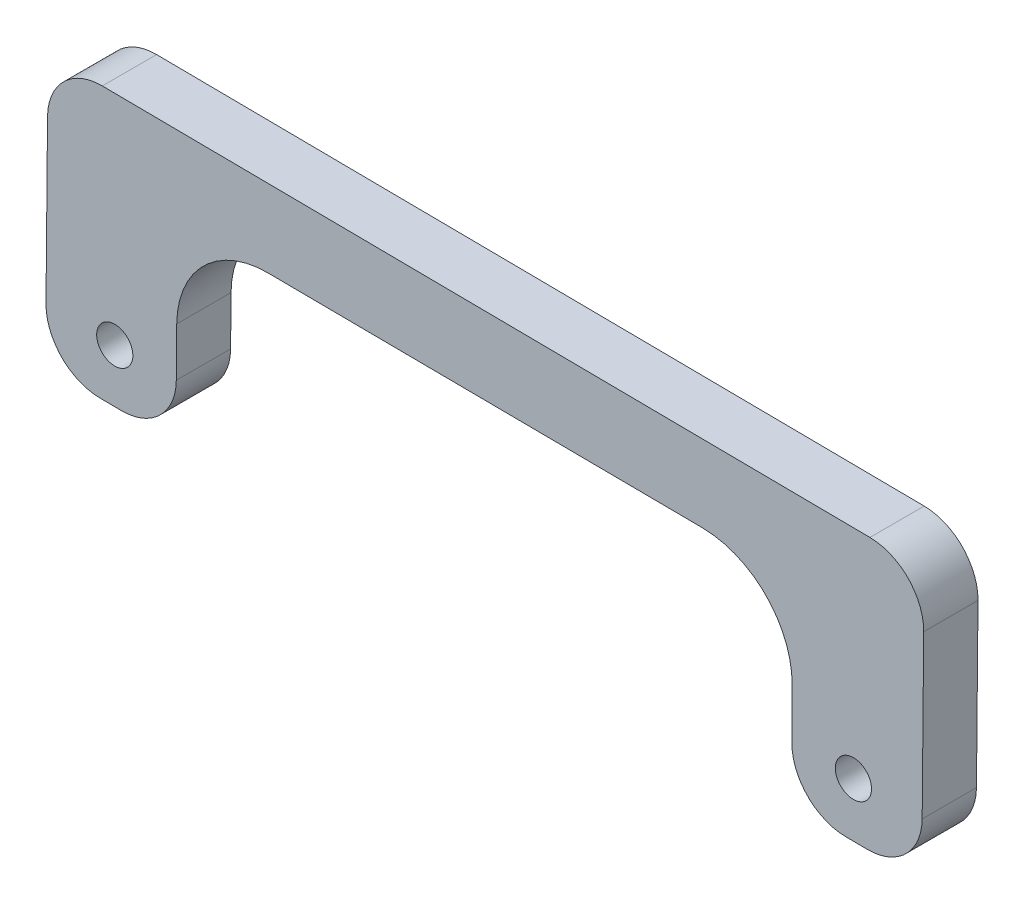
ISO-10303-21;
HEADER;
FILE_DESCRIPTION(('STEP AP214'),'2;1');
FILE_NAME('part.step','',(''),(''),'','','');
FILE_SCHEMA(('AUTOMOTIVE_DESIGN { 1 0 10303 214 1 1 1 1 }'));
ENDSEC;
DATA;
#1=APPLICATION_CONTEXT('core data for automotive mechanical design processes');
#2=APPLICATION_PROTOCOL_DEFINITION('international standard','automotive_design',2000,#1);
#3=PRODUCT_CONTEXT('',#1,'mechanical');
#4=PRODUCT('Part','Part','',(#3));
#5=PRODUCT_RELATED_PRODUCT_CATEGORY('part','',(#4));
#6=PRODUCT_DEFINITION_FORMATION('','',#4);
#7=PRODUCT_DEFINITION_CONTEXT('part definition',#1,'design');
#8=PRODUCT_DEFINITION('design','',#6,#7);
#9=PRODUCT_DEFINITION_SHAPE('','',#8);
#10=(LENGTH_UNIT() NAMED_UNIT(*) SI_UNIT(.MILLI.,.METRE.));
#11=(NAMED_UNIT(*) PLANE_ANGLE_UNIT() SI_UNIT($,.RADIAN.));
#12=(NAMED_UNIT(*) SI_UNIT($,.STERADIAN.) SOLID_ANGLE_UNIT());
#13=UNCERTAINTY_MEASURE_WITH_UNIT(LENGTH_MEASURE(1.E-05),#10,'distance_accuracy_value','');
#14=(GEOMETRIC_REPRESENTATION_CONTEXT(3) GLOBAL_UNCERTAINTY_ASSIGNED_CONTEXT((#13)) GLOBAL_UNIT_ASSIGNED_CONTEXT((#10,
#11,#12)) REPRESENTATION_CONTEXT('',''));
#15=CARTESIAN_POINT('',(0.,0.,0.));
#16=DIRECTION('',(0.,0.,1.));
#17=DIRECTION('',(1.,0.,0.));
#18=AXIS2_PLACEMENT_3D('',#15,#16,#17);
#19=CARTESIAN_POINT('',(0.676192082545131,71.9031510352186,3.));
#20=DIRECTION('',(0.00940379070852319,0.9999557833826,0.));
#21=DIRECTION('',(-0.9999557833826,0.00940379070852319,0.));
#22=AXIS2_PLACEMENT_3D('',#19,#20,#21);
#23=PLANE('',#22);
#24=DIRECTION('',(0.999955783382601,-0.00940379070852319,0.));
#25=VECTOR('',#24,1.);
#26=CARTESIAN_POINT('',(0.676192082545131,71.9031510352186,0.));
#27=LINE('',#26,#25);
#28=CARTESIAN_POINT('',(907.83124051801,63.3720776043414,0.));
#29=VERTEX_POINT('',#28);
#30=CARTESIAN_POINT('',(950.239400984257,62.9732625047317,0.));
#31=VERTEX_POINT('',#30);
#32=EDGE_CURVE('E184',#29,#31,#27,.T.);
#33=ORIENTED_EDGE('',*,*,#32,.F.);
#34=DIRECTION('',(0.,0.,-1.));
#35=VECTOR('',#34,1.);
#36=CARTESIAN_POINT('',(907.83124051801,63.3720776043414,3.));
#37=LINE('',#36,#35);
#38=CARTESIAN_POINT('',(907.83124051801,63.3720776043414,3.));
#39=VERTEX_POINT('',#38);
#40=EDGE_CURVE('E11',#39,#29,#37,.T.);
#41=ORIENTED_EDGE('',*,*,#40,.F.);
#42=DIRECTION('',(0.999955783382601,-0.00940379070852319,0.));
#43=VECTOR('',#42,1.);
#44=CARTESIAN_POINT('',(0.676192082545131,71.9031510352186,3.));
#45=LINE('',#44,#43);
#46=CARTESIAN_POINT('',(950.239400984257,62.9732625047317,3.));
#47=VERTEX_POINT('',#46);
#48=EDGE_CURVE('E277',#39,#47,#45,.T.);
#49=ORIENTED_EDGE('',*,*,#48,.T.);
#50=DIRECTION('',(0.,0.,-1.));
#51=VECTOR('',#50,1.);
#52=CARTESIAN_POINT('',(950.239400984257,62.9732625047317,3.));
#53=LINE('',#52,#51);
#54=EDGE_CURVE('E111',#47,#31,#53,.T.);
#55=ORIENTED_EDGE('',*,*,#54,.T.);
#56=EDGE_LOOP('',(#33,#41,#49,#55));
#57=FACE_BOUND('',#56,.T.);
#58=ADVANCED_FACE('F36',(#57),#23,.T.);
#59=CARTESIAN_POINT('',(907.803029145884,60.3722102541932,3.));
#60=DIRECTION('',(0.,0.,-1.));
#61=DIRECTION('',(-1.,0.,0.));
#62=AXIS2_PLACEMENT_3D('',#59,#60,#61);
#63=CYLINDRICAL_SURFACE('',#62,3.00000000000044);
#64=CARTESIAN_POINT('',(907.803029145884,60.3722102541932,0.));
#65=DIRECTION('',(0.,0.,1.));
#66=DIRECTION('',(1.,0.,0.));
#67=AXIS2_PLACEMENT_3D('',#64,#65,#66);
#68=CIRCLE('',#67,3.00000000000044);
#69=CARTESIAN_POINT('',(904.803161795736,60.4004216263188,0.));
#70=VERTEX_POINT('',#69);
#71=EDGE_CURVE('E187',#29,#70,#68,.T.);
#72=ORIENTED_EDGE('',*,*,#71,.T.);
#73=DIRECTION('',(0.,0.,-1.));
#74=VECTOR('',#73,1.);
#75=CARTESIAN_POINT('',(904.803161795736,60.4004216263188,3.));
#76=LINE('',#75,#74);
#77=CARTESIAN_POINT('',(904.803161795736,60.4004216263188,3.));
#78=VERTEX_POINT('',#77);
#79=EDGE_CURVE('E45',#78,#70,#76,.T.);
#80=ORIENTED_EDGE('',*,*,#79,.F.);
#81=CARTESIAN_POINT('',(907.803029145884,60.3722102541932,3.));
#82=DIRECTION('',(0.,0.,1.));
#83=DIRECTION('',(1.,0.,0.));
#84=AXIS2_PLACEMENT_3D('',#81,#82,#83);
#85=CIRCLE('',#84,3.00000000000044);
#86=EDGE_CURVE('E275',#39,#78,#85,.T.);
#87=ORIENTED_EDGE('',*,*,#86,.F.);
#88=ORIENTED_EDGE('',*,*,#40,.T.);
#89=EDGE_LOOP('',(#72,#80,#87,#88));
#90=FACE_BOUND('',#89,.T.);
#91=ADVANCED_FACE('F260',(#90),#63,.T.);
#92=CARTESIAN_POINT('',(904.155181085324,-8.50286205866326,3.));
#93=DIRECTION('',(-0.999955783382601,0.00940379070842536,0.));
#94=DIRECTION('',(-0.00940379070842536,-0.999955783382601,0.));
#95=AXIS2_PLACEMENT_3D('',#92,#93,#94);
#96=PLANE('',#95);
#97=DIRECTION('',(0.00940379070842536,0.999955783382602,0.));
#98=VECTOR('',#97,1.);
#99=CARTESIAN_POINT('',(904.155181085324,-8.50286205866326,0.));
#100=LINE('',#99,#98);
#101=CARTESIAN_POINT('',(904.71852767936,51.4008195758756,0.));
#102=VERTEX_POINT('',#101);
#103=EDGE_CURVE('E190',#102,#70,#100,.T.);
#104=ORIENTED_EDGE('',*,*,#103,.F.);
#105=DIRECTION('',(0.,0.,-1.));
#106=VECTOR('',#105,1.);
#107=CARTESIAN_POINT('',(904.71852767936,51.4008195758756,3.));
#108=LINE('',#107,#106);
#109=CARTESIAN_POINT('',(904.71852767936,51.4008195758756,3.));
#110=VERTEX_POINT('',#109);
#111=EDGE_CURVE('E250',#110,#102,#108,.T.);
#112=ORIENTED_EDGE('',*,*,#111,.F.);
#113=DIRECTION('',(0.00940379070842536,0.999955783382602,0.));
#114=VECTOR('',#113,1.);
#115=CARTESIAN_POINT('',(904.155181085324,-8.50286205866326,3.));
#116=LINE('',#115,#114);
#117=EDGE_CURVE('E257',#110,#78,#116,.T.);
#118=ORIENTED_EDGE('',*,*,#117,.T.);
#119=ORIENTED_EDGE('',*,*,#79,.T.);
#120=EDGE_LOOP('',(#104,#112,#118,#119));
#121=FACE_BOUND('',#120,.T.);
#122=ADVANCED_FACE('F255',(#121),#96,.T.);
#123=CARTESIAN_POINT('',(907.718395029508,51.3726082037505,3.));
#124=DIRECTION('',(0.,0.,-1.));
#125=DIRECTION('',(-1.,0.,0.));
#126=AXIS2_PLACEMENT_3D('',#123,#124,#125);
#127=CYLINDRICAL_SURFACE('',#126,3.00000000000032);
#128=CARTESIAN_POINT('',(907.718395029508,51.3726082037505,0.));
#129=DIRECTION('',(0.,0.,1.));
#130=DIRECTION('',(1.,0.,0.));
#131=AXIS2_PLACEMENT_3D('',#128,#129,#130);
#132=CIRCLE('',#131,3.00000000000032);
#133=CARTESIAN_POINT('',(907.690183657383,48.3727408536023,0.));
#134=VERTEX_POINT('',#133);
#135=EDGE_CURVE('E193',#102,#134,#132,.T.);
#136=ORIENTED_EDGE('',*,*,#135,.T.);
#137=DIRECTION('',(0.,0.,-1.));
#138=VECTOR('',#137,1.);
#139=CARTESIAN_POINT('',(907.690183657383,48.3727408536023,3.));
#140=LINE('',#139,#138);
#141=CARTESIAN_POINT('',(907.690183657383,48.3727408536023,3.));
#142=VERTEX_POINT('',#141);
#143=EDGE_CURVE('E248',#142,#134,#140,.T.);
#144=ORIENTED_EDGE('',*,*,#143,.F.);
#145=CARTESIAN_POINT('',(907.718395029508,51.3726082037505,3.));
#146=DIRECTION('',(0.,0.,1.));
#147=DIRECTION('',(1.,0.,0.));
#148=AXIS2_PLACEMENT_3D('',#145,#146,#147);
#149=CIRCLE('',#148,3.00000000000032);
#150=EDGE_CURVE('E271',#110,#142,#149,.T.);
#151=ORIENTED_EDGE('',*,*,#150,.F.);
#152=ORIENTED_EDGE('',*,*,#111,.T.);
#153=EDGE_LOOP('',(#136,#144,#151,#152));
#154=FACE_BOUND('',#153,.T.);
#155=ADVANCED_FACE('F268',(#154),#127,.T.);
#156=CARTESIAN_POINT('',(0.535135221910367,56.9038142843838,3.));
#157=DIRECTION('',(-0.00940379070841751,-0.999955783382601,0.));
#158=DIRECTION('',(0.999955783382601,-0.00940379070841751,0.));
#159=AXIS2_PLACEMENT_3D('',#156,#157,#158);
#160=PLANE('',#159);
#161=DIRECTION('',(-0.999955783382601,0.00940379070841751,0.));
#162=VECTOR('',#161,1.);
#163=CARTESIAN_POINT('',(0.535135221910367,56.9038142843838,0.));
#164=LINE('',#163,#162);
#165=CARTESIAN_POINT('',(908.890130597442,48.3614563047522,0.));
#166=VERTEX_POINT('',#165);
#167=EDGE_CURVE('E196',#166,#134,#164,.T.);
#168=ORIENTED_EDGE('',*,*,#167,.F.);
#169=DIRECTION('',(0.,0.,-1.));
#170=VECTOR('',#169,1.);
#171=CARTESIAN_POINT('',(908.890130597442,48.3614563047522,3.));
#172=LINE('',#171,#170);
#173=CARTESIAN_POINT('',(908.890130597442,48.3614563047522,3.));
#174=VERTEX_POINT('',#173);
#175=EDGE_CURVE('E246',#174,#166,#172,.T.);
#176=ORIENTED_EDGE('',*,*,#175,.F.);
#177=DIRECTION('',(-0.999955783382601,0.00940379070841751,0.));
#178=VECTOR('',#177,1.);
#179=CARTESIAN_POINT('',(0.535135221910367,56.9038142843838,3.));
#180=LINE('',#179,#178);
#181=EDGE_CURVE('E273',#174,#142,#180,.T.);
#182=ORIENTED_EDGE('',*,*,#181,.T.);
#183=ORIENTED_EDGE('',*,*,#143,.T.);
#184=EDGE_LOOP('',(#168,#176,#182,#183));
#185=FACE_BOUND('',#184,.T.);
#186=ADVANCED_FACE('F342',(#185),#160,.T.);
#187=CARTESIAN_POINT('',(908.918341969567,51.3613236549003,3.));
#188=DIRECTION('',(0.,0.,-1.));
#189=DIRECTION('',(-1.,0.,0.));
#190=AXIS2_PLACEMENT_3D('',#187,#188,#189);
#191=CYLINDRICAL_SURFACE('',#190,3.00000000000019);
#192=CARTESIAN_POINT('',(908.918341969567,51.3613236549003,0.));
#193=DIRECTION('',(0.,0.,1.));
#194=DIRECTION('',(1.,0.,0.));
#195=AXIS2_PLACEMENT_3D('',#192,#193,#194);
#196=CIRCLE('',#195,3.00000000000019);
#197=CARTESIAN_POINT('',(911.918209319715,51.3331122827657,0.));
#198=VERTEX_POINT('',#197);
#199=EDGE_CURVE('E199',#166,#198,#196,.T.);
#200=ORIENTED_EDGE('',*,*,#199,.T.);
#201=DIRECTION('',(0.,0.,-1.));
#202=VECTOR('',#201,1.);
#203=CARTESIAN_POINT('',(911.918209319715,51.3331122827657,3.));
#204=LINE('',#203,#202);
#205=CARTESIAN_POINT('',(911.918209319715,51.3331122827657,3.));
#206=VERTEX_POINT('',#205);
#207=EDGE_CURVE('E244',#206,#198,#204,.T.);
#208=ORIENTED_EDGE('',*,*,#207,.F.);
#209=CARTESIAN_POINT('',(908.918341969567,51.3613236549003,3.));
#210=DIRECTION('',(0.,0.,1.));
#211=DIRECTION('',(1.,0.,0.));
#212=AXIS2_PLACEMENT_3D('',#209,#210,#211);
#213=CIRCLE('',#212,3.00000000000019);
#214=EDGE_CURVE('E282',#174,#206,#213,.T.);
#215=ORIENTED_EDGE('',*,*,#214,.F.);
#216=ORIENTED_EDGE('',*,*,#175,.T.);
#217=EDGE_LOOP('',(#200,#208,#215,#216));
#218=FACE_BOUND('',#217,.T.);
#219=ADVANCED_FACE('F345',(#218),#191,.T.);
#220=CARTESIAN_POINT('',(911.411344971888,-7.81080966194235,3.));
#221=DIRECTION('',(0.999963279436961,-0.0085697011428519,0.));
#222=DIRECTION('',(0.0085697011428519,0.999963279436961,0.));
#223=AXIS2_PLACEMENT_3D('',#220,#221,#222);
#224=PLANE('',#223);
#225=DIRECTION('',(-0.0085697011428519,-0.999963279436961,0.));
#226=VECTOR('',#225,1.);
#227=CARTESIAN_POINT('',(911.411344971888,-7.81080966194235,0.));
#228=LINE('',#227,#226);
#229=CARTESIAN_POINT('',(911.941412270201,54.0405694126802,0.));
#230=VERTEX_POINT('',#229);
#231=EDGE_CURVE('E202',#230,#198,#228,.T.);
#232=ORIENTED_EDGE('',*,*,#231,.F.);
#233=DIRECTION('',(0.,0.,-1.));
#234=VECTOR('',#233,1.);
#235=CARTESIAN_POINT('',(911.941412270201,54.0405694126802,3.));
#236=LINE('',#235,#234);
#237=CARTESIAN_POINT('',(911.941412270201,54.0405694126802,3.));
#238=VERTEX_POINT('',#237);
#239=EDGE_CURVE('E242',#238,#230,#236,.T.);
#240=ORIENTED_EDGE('',*,*,#239,.F.);
#241=DIRECTION('',(-0.0085697011428519,-0.999963279436961,0.));
#242=VECTOR('',#241,1.);
#243=CARTESIAN_POINT('',(911.411344971888,-7.81080966194235,3.));
#244=LINE('',#243,#242);
#245=EDGE_CURVE('E284',#238,#206,#244,.T.);
#246=ORIENTED_EDGE('',*,*,#245,.T.);
#247=ORIENTED_EDGE('',*,*,#207,.T.);
#248=EDGE_LOOP('',(#232,#240,#246,#247));
#249=FACE_BOUND('',#248,.T.);
#250=ADVANCED_FACE('F349',(#249),#224,.T.);
#251=CARTESIAN_POINT('',(916.941249001885,54.0001632683156,3.));
#252=DIRECTION('',(0.,0.,-1.));
#253=DIRECTION('',(-1.,0.,0.));
#254=AXIS2_PLACEMENT_3D('',#251,#252,#253);
#255=CYLINDRICAL_SURFACE('',#254,5.00000000000024);
#256=CARTESIAN_POINT('',(916.941249001885,54.0001632683156,0.));
#257=DIRECTION('',(0.,0.,1.));
#258=DIRECTION('',(1.,0.,0.));
#259=AXIS2_PLACEMENT_3D('',#256,#257,#258);
#260=CIRCLE('',#259,5.00000000000024);
#261=CARTESIAN_POINT('',(916.981655146256,58.9999999999998,0.));
#262=VERTEX_POINT('',#261);
#263=EDGE_CURVE('E205',#262,#230,#260,.T.);
#264=ORIENTED_EDGE('',*,*,#263,.F.);
#265=DIRECTION('',(0.,0.,-1.));
#266=VECTOR('',#265,1.);
#267=CARTESIAN_POINT('',(916.981655146256,58.9999999999998,3.));
#268=LINE('',#267,#266);
#269=CARTESIAN_POINT('',(916.981655146256,58.9999999999998,3.));
#270=VERTEX_POINT('',#269);
#271=EDGE_CURVE('E240',#270,#262,#268,.T.);
#272=ORIENTED_EDGE('',*,*,#271,.F.);
#273=CARTESIAN_POINT('',(916.941249001885,54.0001632683156,3.));
#274=DIRECTION('',(0.,0.,1.));
#275=DIRECTION('',(1.,0.,0.));
#276=AXIS2_PLACEMENT_3D('',#273,#274,#275);
#277=CIRCLE('',#276,5.00000000000024);
#278=EDGE_CURVE('E287',#270,#238,#277,.T.);
#279=ORIENTED_EDGE('',*,*,#278,.T.);
#280=ORIENTED_EDGE('',*,*,#239,.T.);
#281=EDGE_LOOP('',(#264,#272,#279,#280));
#282=FACE_BOUND('',#281,.T.);
#283=ADVANCED_FACE('F353',(#282),#255,.F.);
#284=CARTESIAN_POINT('',(0.536661577057294,66.4062435847256,3.));
#285=DIRECTION('',(-0.00808122887430341,-0.99996734633681,0.));
#286=DIRECTION('',(0.99996734633681,-0.00808122887430341,0.));
#287=AXIS2_PLACEMENT_3D('',#284,#285,#286);
#288=PLANE('',#287);
#289=DIRECTION('',(-0.99996734633681,0.00808122887430341,0.));
#290=VECTOR('',#289,1.);
#291=CARTESIAN_POINT('',(0.536661577057294,66.4062435847256,0.));
#292=LINE('',#291,#290);
#293=CARTESIAN_POINT('',(940.98467424353,58.8060197748355,0.));
#294=VERTEX_POINT('',#293);
#295=EDGE_CURVE('E208',#294,#262,#292,.T.);
#296=ORIENTED_EDGE('',*,*,#295,.F.);
#297=DIRECTION('',(0.,0.,-1.));
#298=VECTOR('',#297,1.);
#299=CARTESIAN_POINT('',(940.98467424353,58.8060197748355,3.));
#300=LINE('',#299,#298);
#301=CARTESIAN_POINT('',(940.98467424353,58.8060197748355,3.));
#302=VERTEX_POINT('',#301);
#303=EDGE_CURVE('E238',#302,#294,#300,.T.);
#304=ORIENTED_EDGE('',*,*,#303,.F.);
#305=DIRECTION('',(-0.99996734633681,0.00808122887430341,0.));
#306=VECTOR('',#305,1.);
#307=CARTESIAN_POINT('',(0.536661577057294,66.4062435847256,3.));
#308=LINE('',#307,#306);
#309=EDGE_CURVE('E290',#302,#270,#308,.T.);
#310=ORIENTED_EDGE('',*,*,#309,.T.);
#311=ORIENTED_EDGE('',*,*,#271,.T.);
#312=EDGE_LOOP('',(#296,#304,#310,#311));
#313=FACE_BOUND('',#312,.T.);
#314=ADVANCED_FACE('F357',(#313),#288,.T.);
#315=CARTESIAN_POINT('',(940.944268099158,53.8061830431514,3.));
#316=DIRECTION('',(0.,0.,-1.));
#317=DIRECTION('',(-1.,0.,0.));
#318=AXIS2_PLACEMENT_3D('',#315,#316,#317);
#319=CYLINDRICAL_SURFACE('',#318,5.00000000000007);
#320=CARTESIAN_POINT('',(940.944268099158,53.8061830431514,0.));
#321=DIRECTION('',(0.,0.,1.));
#322=DIRECTION('',(1.,0.,0.));
#323=AXIS2_PLACEMENT_3D('',#320,#321,#322);
#324=CIRCLE('',#323,5.00000000000007);
#325=CARTESIAN_POINT('',(945.944104830842,53.7657768987825,0.));
#326=VERTEX_POINT('',#325);
#327=EDGE_CURVE('E211',#326,#294,#324,.T.);
#328=ORIENTED_EDGE('',*,*,#327,.F.);
#329=DIRECTION('',(0.,0.,-1.));
#330=VECTOR('',#329,1.);
#331=CARTESIAN_POINT('',(945.944104830842,53.7657768987825,3.));
#332=LINE('',#331,#330);
#333=CARTESIAN_POINT('',(945.944104830842,53.7657768987825,3.));
#334=VERTEX_POINT('',#333);
#335=EDGE_CURVE('E236',#334,#326,#332,.T.);
#336=ORIENTED_EDGE('',*,*,#335,.F.);
#337=CARTESIAN_POINT('',(940.944268099158,53.8061830431514,3.));
#338=DIRECTION('',(0.,0.,1.));
#339=DIRECTION('',(1.,0.,0.));
#340=AXIS2_PLACEMENT_3D('',#337,#338,#339);
#341=CIRCLE('',#340,5.00000000000007);
#342=EDGE_CURVE('E293',#334,#302,#341,.T.);
#343=ORIENTED_EDGE('',*,*,#342,.T.);
#344=ORIENTED_EDGE('',*,*,#303,.T.);
#345=EDGE_LOOP('',(#328,#336,#343,#344));
#346=FACE_BOUND('',#345,.T.);
#347=ADVANCED_FACE('F361',(#346),#319,.F.);
#348=CARTESIAN_POINT('',(945.567303130637,-5.96495864688537,3.));
#349=DIRECTION('',(-0.999980103026373,0.00630821300875333,0.));
#350=DIRECTION('',(-0.00630821300875333,-0.999980103026373,0.));
#351=AXIS2_PLACEMENT_3D('',#348,#349,#350);
#352=PLANE('',#351);
#353=DIRECTION('',(0.00630821300875333,0.999980103026373,0.));
#354=VECTOR('',#353,1.);
#355=CARTESIAN_POINT('',(945.567303130637,-5.96495864688537,0.));
#356=LINE('',#355,#354);
#357=CARTESIAN_POINT('',(945.926741205548,51.0132890251154,0.));
#358=VERTEX_POINT('',#357);
#359=EDGE_CURVE('E214',#358,#326,#356,.T.);
#360=ORIENTED_EDGE('',*,*,#359,.F.);
#361=DIRECTION('',(0.,0.,-1.));
#362=VECTOR('',#361,1.);
#363=CARTESIAN_POINT('',(945.926741205548,51.0132890251154,3.));
#364=LINE('',#363,#362);
#365=CARTESIAN_POINT('',(945.926741205548,51.0132890251154,3.));
#366=VERTEX_POINT('',#365);
#367=EDGE_CURVE('E234',#366,#358,#364,.T.);
#368=ORIENTED_EDGE('',*,*,#367,.F.);
#369=DIRECTION('',(0.00630821300875333,0.999980103026373,0.));
#370=VECTOR('',#369,1.);
#371=CARTESIAN_POINT('',(945.567303130637,-5.96495864688537,3.));
#372=LINE('',#371,#370);
#373=EDGE_CURVE('E296',#366,#334,#372,.T.);
#374=ORIENTED_EDGE('',*,*,#373,.T.);
#375=ORIENTED_EDGE('',*,*,#335,.T.);
#376=EDGE_LOOP('',(#360,#368,#374,#375));
#377=FACE_BOUND('',#376,.T.);
#378=ADVANCED_FACE('F365',(#377),#352,.T.);
#379=CARTESIAN_POINT('',(948.926608555695,50.9850776529902,3.));
#380=DIRECTION('',(0.,0.,-1.));
#381=DIRECTION('',(-1.,0.,0.));
#382=AXIS2_PLACEMENT_3D('',#379,#380,#381);
#383=CYLINDRICAL_SURFACE('',#382,2.99999999999959);
#384=CARTESIAN_POINT('',(948.926608555695,50.9850776529902,0.));
#385=DIRECTION('',(0.,0.,1.));
#386=DIRECTION('',(1.,0.,0.));
#387=AXIS2_PLACEMENT_3D('',#384,#385,#386);
#388=CIRCLE('',#387,2.99999999999959);
#389=CARTESIAN_POINT('',(948.898397183569,47.9852103028428,0.));
#390=VERTEX_POINT('',#389);
#391=EDGE_CURVE('E217',#358,#390,#388,.T.);
#392=ORIENTED_EDGE('',*,*,#391,.T.);
#393=DIRECTION('',(0.,0.,-1.));
#394=VECTOR('',#393,1.);
#395=CARTESIAN_POINT('',(948.898397183569,47.9852103028428,3.));
#396=LINE('',#395,#394);
#397=CARTESIAN_POINT('',(948.898397183569,47.9852103028428,3.));
#398=VERTEX_POINT('',#397);
#399=EDGE_CURVE('E232',#398,#390,#396,.T.);
#400=ORIENTED_EDGE('',*,*,#399,.F.);
#401=CARTESIAN_POINT('',(948.926608555695,50.9850776529902,3.));
#402=DIRECTION('',(0.,0.,1.));
#403=DIRECTION('',(1.,0.,0.));
#404=AXIS2_PLACEMENT_3D('',#401,#402,#403);
#405=CIRCLE('',#404,2.99999999999959);
#406=EDGE_CURVE('E299',#366,#398,#405,.T.);
#407=ORIENTED_EDGE('',*,*,#406,.F.);
#408=ORIENTED_EDGE('',*,*,#367,.T.);
#409=EDGE_LOOP('',(#392,#400,#407,#408));
#410=FACE_BOUND('',#409,.T.);
#411=ADVANCED_FACE('F369',(#410),#383,.T.);
#412=CARTESIAN_POINT('',(0.535135221912977,56.9038142844201,3.));
#413=DIRECTION('',(-0.00940379070845736,-0.999955783382601,0.));
#414=DIRECTION('',(0.999955783382601,-0.00940379070845736,0.));
#415=AXIS2_PLACEMENT_3D('',#412,#413,#414);
#416=PLANE('',#415);
#417=DIRECTION('',(-0.999955783382601,0.00940379070845736,0.));
#418=VECTOR('',#417,1.);
#419=CARTESIAN_POINT('',(0.535135221912977,56.9038142844201,0.));
#420=LINE('',#419,#418);
#421=CARTESIAN_POINT('',(950.09834412363,47.9739257539926,0.));
#422=VERTEX_POINT('',#421);
#423=EDGE_CURVE('E220',#422,#390,#420,.T.);
#424=ORIENTED_EDGE('',*,*,#423,.F.);
#425=DIRECTION('',(0.,0.,-1.));
#426=VECTOR('',#425,1.);
#427=CARTESIAN_POINT('',(950.09834412363,47.9739257539926,3.));
#428=LINE('',#427,#426);
#429=CARTESIAN_POINT('',(950.09834412363,47.9739257539926,3.));
#430=VERTEX_POINT('',#429);
#431=EDGE_CURVE('E171',#430,#422,#428,.T.);
#432=ORIENTED_EDGE('',*,*,#431,.F.);
#433=DIRECTION('',(-0.999955783382601,0.00940379070845736,0.));
#434=VECTOR('',#433,1.);
#435=CARTESIAN_POINT('',(0.535135221912977,56.9038142844201,3.));
#436=LINE('',#435,#434);
#437=EDGE_CURVE('E160',#430,#398,#436,.T.);
#438=ORIENTED_EDGE('',*,*,#437,.T.);
#439=ORIENTED_EDGE('',*,*,#399,.T.);
#440=EDGE_LOOP('',(#424,#432,#438,#439));
#441=FACE_BOUND('',#440,.T.);
#442=ADVANCED_FACE('F302',(#441),#416,.T.);
#443=CARTESIAN_POINT('',(950.126555495755,50.9737931041405,3.));
#444=DIRECTION('',(0.,0.,-1.));
#445=DIRECTION('',(-1.,0.,0.));
#446=AXIS2_PLACEMENT_3D('',#443,#444,#445);
#447=CYLINDRICAL_SURFACE('',#446,3.00000000000007);
#448=CARTESIAN_POINT('',(950.126555495755,50.9737931041405,0.));
#449=DIRECTION('',(0.,0.,1.));
#450=DIRECTION('',(1.,0.,0.));
#451=AXIS2_PLACEMENT_3D('',#448,#449,#450);
#452=CIRCLE('',#451,3.00000000000007);
#453=CARTESIAN_POINT('',(953.126422845902,50.9455817320153,0.));
#454=VERTEX_POINT('',#453);
#455=EDGE_CURVE('E167',#422,#454,#452,.T.);
#456=ORIENTED_EDGE('',*,*,#455,.T.);
#457=DIRECTION('',(0.,0.,-1.));
#458=VECTOR('',#457,1.);
#459=CARTESIAN_POINT('',(953.126422845902,50.9455817320153,3.));
#460=LINE('',#459,#458);
#461=CARTESIAN_POINT('',(953.126422845902,50.9455817320153,3.));
#462=VERTEX_POINT('',#461);
#463=EDGE_CURVE('E164',#462,#454,#460,.T.);
#464=ORIENTED_EDGE('',*,*,#463,.F.);
#465=CARTESIAN_POINT('',(950.126555495755,50.9737931041405,3.));
#466=DIRECTION('',(0.,0.,1.));
#467=DIRECTION('',(1.,0.,0.));
#468=AXIS2_PLACEMENT_3D('',#465,#466,#467);
#469=CIRCLE('',#468,3.00000000000007);
#470=EDGE_CURVE('E154',#430,#462,#469,.T.);
#471=ORIENTED_EDGE('',*,*,#470,.F.);
#472=ORIENTED_EDGE('',*,*,#431,.T.);
#473=EDGE_LOOP('',(#456,#464,#471,#472));
#474=FACE_BOUND('',#473,.T.);
#475=ADVANCED_FACE('F165',(#474),#447,.T.);
#476=CARTESIAN_POINT('',(952.563076251866,-8.95809990252187,3.));
#477=DIRECTION('',(0.999955783382601,-0.00940379070842482,0.));
#478=DIRECTION('',(0.00940379070842483,0.999955783382601,0.));
#479=AXIS2_PLACEMENT_3D('',#476,#477,#478);
#480=PLANE('',#479);
#481=DIRECTION('',(-0.00940379070842483,-0.999955783382601,0.));
#482=VECTOR('',#481,1.);
#483=CARTESIAN_POINT('',(952.563076251866,-8.95809990252187,0.));
#484=LINE('',#483,#482);
#485=CARTESIAN_POINT('',(953.211056962278,59.945183782459,0.));
#486=VERTEX_POINT('',#485);
#487=EDGE_CURVE('E224',#486,#454,#484,.T.);
#488=ORIENTED_EDGE('',*,*,#487,.F.);
#489=DIRECTION('',(0.,0.,-1.));
#490=VECTOR('',#489,1.);
#491=CARTESIAN_POINT('',(953.211056962278,59.945183782459,3.));
#492=LINE('',#491,#490);
#493=CARTESIAN_POINT('',(953.211056962278,59.945183782459,3.));
#494=VERTEX_POINT('',#493);
#495=EDGE_CURVE('E104',#494,#486,#492,.T.);
#496=ORIENTED_EDGE('',*,*,#495,.F.);
#497=DIRECTION('',(-0.00940379070842483,-0.999955783382601,0.));
#498=VECTOR('',#497,1.);
#499=CARTESIAN_POINT('',(952.563076251866,-8.95809990252187,3.));
#500=LINE('',#499,#498);
#501=EDGE_CURVE('E158',#494,#462,#500,.T.);
#502=ORIENTED_EDGE('',*,*,#501,.T.);
#503=ORIENTED_EDGE('',*,*,#463,.T.);
#504=EDGE_LOOP('',(#488,#496,#502,#503));
#505=FACE_BOUND('',#504,.T.);
#506=ADVANCED_FACE('F173',(#505),#480,.T.);
#507=CARTESIAN_POINT('',(908.517923465042,51.3111110870678,3.));
#508=DIRECTION('',(0.,0.,-1.));
#509=DIRECTION('',(-1.,0.,0.));
#510=AXIS2_PLACEMENT_3D('',#507,#508,#509);
#511=CYLINDRICAL_SURFACE('',#510,1.);
#512=CARTESIAN_POINT('',(908.517923465042,51.3111110870678,3.));
#513=DIRECTION('',(0.,0.,1.));
#514=DIRECTION('',(1.,0.,0.));
#515=AXIS2_PLACEMENT_3D('',#512,#513,#514);
#516=CIRCLE('',#515,1.);
#517=CARTESIAN_POINT('',(909.517923465042,51.3111110870678,3.));
#518=VERTEX_POINT('',#517);
#519=EDGE_CURVE('E306',#518,#518,#516,.T.);
#520=ORIENTED_EDGE('',*,*,#519,.T.);
#521=EDGE_LOOP('',(#520));
#522=FACE_BOUND('',#521,.T.);
#523=CARTESIAN_POINT('',(908.517923465042,51.3111110870678,0.));
#524=DIRECTION('',(0.,0.,1.));
#525=DIRECTION('',(1.,0.,0.));
#526=AXIS2_PLACEMENT_3D('',#523,#524,#525);
#527=CIRCLE('',#526,1.);
#528=CARTESIAN_POINT('',(909.517923465042,51.3111110870678,0.));
#529=VERTEX_POINT('',#528);
#530=EDGE_CURVE('E181',#529,#529,#527,.T.);
#531=ORIENTED_EDGE('',*,*,#530,.F.);
#532=EDGE_LOOP('',(#531));
#533=FACE_BOUND('',#532,.T.);
#534=ADVANCED_FACE('F320',(#522,#533),#511,.F.);
#535=CARTESIAN_POINT('',(949.326590869047,50.9813161367076,3.));
#536=DIRECTION('',(0.,0.,-1.));
#537=DIRECTION('',(-1.,0.,0.));
#538=AXIS2_PLACEMENT_3D('',#535,#536,#537);
#539=CYLINDRICAL_SURFACE('',#538,1.);
#540=CARTESIAN_POINT('',(949.326590869047,50.9813161367076,3.));
#541=DIRECTION('',(0.,0.,1.));
#542=DIRECTION('',(1.,0.,0.));
#543=AXIS2_PLACEMENT_3D('',#540,#541,#542);
#544=CIRCLE('',#543,1.);
#545=CARTESIAN_POINT('',(950.326590869047,50.9813161367076,3.));
#546=VERTEX_POINT('',#545);
#547=EDGE_CURVE('E228',#546,#546,#544,.T.);
#548=ORIENTED_EDGE('',*,*,#547,.T.);
#549=EDGE_LOOP('',(#548));
#550=FACE_BOUND('',#549,.T.);
#551=CARTESIAN_POINT('',(949.326590869047,50.9813161367076,0.));
#552=DIRECTION('',(0.,0.,1.));
#553=DIRECTION('',(1.,0.,0.));
#554=AXIS2_PLACEMENT_3D('',#551,#552,#553);
#555=CIRCLE('',#554,1.);
#556=CARTESIAN_POINT('',(950.326590869047,50.9813161367076,0.));
#557=VERTEX_POINT('',#556);
#558=EDGE_CURVE('E178',#557,#557,#555,.T.);
#559=ORIENTED_EDGE('',*,*,#558,.F.);
#560=EDGE_LOOP('',(#559));
#561=FACE_BOUND('',#560,.T.);
#562=ADVANCED_FACE('F38',(#550,#561),#539,.F.);
#563=CARTESIAN_POINT('',(950.211189612131,59.9733951545845,3.));
#564=DIRECTION('',(0.,0.,-1.));
#565=DIRECTION('',(-1.,0.,0.));
#566=AXIS2_PLACEMENT_3D('',#563,#564,#565);
#567=CYLINDRICAL_SURFACE('',#566,2.99999999999943);
#568=CARTESIAN_POINT('',(950.211189612131,59.9733951545845,0.));
#569=DIRECTION('',(0.,0.,1.));
#570=DIRECTION('',(1.,0.,0.));
#571=AXIS2_PLACEMENT_3D('',#568,#569,#570);
#572=CIRCLE('',#571,2.99999999999943);
#573=EDGE_CURVE('E226',#486,#31,#572,.T.);
#574=ORIENTED_EDGE('',*,*,#573,.T.);
#575=ORIENTED_EDGE('',*,*,#54,.F.);
#576=CARTESIAN_POINT('',(950.211189612131,59.9733951545845,3.));
#577=DIRECTION('',(0.,0.,1.));
#578=DIRECTION('',(1.,0.,0.));
#579=AXIS2_PLACEMENT_3D('',#576,#577,#578);
#580=CIRCLE('',#579,2.99999999999943);
#581=EDGE_CURVE('E53',#494,#47,#580,.T.);
#582=ORIENTED_EDGE('',*,*,#581,.F.);
#583=ORIENTED_EDGE('',*,*,#495,.T.);
#584=EDGE_LOOP('',(#574,#575,#582,#583));
#585=FACE_BOUND('',#584,.T.);
#586=ADVANCED_FACE('F305',(#585),#567,.T.);
#587=CARTESIAN_POINT('',(0.,0.,3.));
#588=DIRECTION('',(0.,0.,1.));
#589=DIRECTION('',(1.,0.,0.));
#590=AXIS2_PLACEMENT_3D('',#587,#588,#589);
#591=PLANE('',#590);
#592=ORIENTED_EDGE('',*,*,#547,.F.);
#593=EDGE_LOOP('',(#592));
#594=FACE_BOUND('',#593,.T.);
#595=ORIENTED_EDGE('',*,*,#519,.F.);
#596=EDGE_LOOP('',(#595));
#597=FACE_BOUND('',#596,.T.);
#598=ORIENTED_EDGE('',*,*,#48,.F.);
#599=ORIENTED_EDGE('',*,*,#86,.T.);
#600=ORIENTED_EDGE('',*,*,#117,.F.);
#601=ORIENTED_EDGE('',*,*,#150,.T.);
#602=ORIENTED_EDGE('',*,*,#181,.F.);
#603=ORIENTED_EDGE('',*,*,#214,.T.);
#604=ORIENTED_EDGE('',*,*,#245,.F.);
#605=ORIENTED_EDGE('',*,*,#278,.F.);
#606=ORIENTED_EDGE('',*,*,#309,.F.);
#607=ORIENTED_EDGE('',*,*,#342,.F.);
#608=ORIENTED_EDGE('',*,*,#373,.F.);
#609=ORIENTED_EDGE('',*,*,#406,.T.);
#610=ORIENTED_EDGE('',*,*,#437,.F.);
#611=ORIENTED_EDGE('',*,*,#470,.T.);
#612=ORIENTED_EDGE('',*,*,#501,.F.);
#613=ORIENTED_EDGE('',*,*,#581,.T.);
#614=EDGE_LOOP('',(#598,#599,#600,#601,#602,#603,#604,#605,#606,#607,#608,#609,#610,#611,#612,#613));
#615=FACE_BOUND('',#614,.T.);
#616=ADVANCED_FACE('F156',(#594,#597,#615),#591,.T.);
#617=CARTESIAN_POINT('',(0.,0.,0.));
#618=DIRECTION('',(0.,0.,1.));
#619=DIRECTION('',(1.,0.,0.));
#620=AXIS2_PLACEMENT_3D('',#617,#618,#619);
#621=PLANE('',#620);
#622=ORIENTED_EDGE('',*,*,#558,.T.);
#623=EDGE_LOOP('',(#622));
#624=FACE_BOUND('',#623,.T.);
#625=ORIENTED_EDGE('',*,*,#530,.T.);
#626=EDGE_LOOP('',(#625));
#627=FACE_BOUND('',#626,.T.);
#628=ORIENTED_EDGE('',*,*,#32,.T.);
#629=ORIENTED_EDGE('',*,*,#573,.F.);
#630=ORIENTED_EDGE('',*,*,#487,.T.);
#631=ORIENTED_EDGE('',*,*,#455,.F.);
#632=ORIENTED_EDGE('',*,*,#423,.T.);
#633=ORIENTED_EDGE('',*,*,#391,.F.);
#634=ORIENTED_EDGE('',*,*,#359,.T.);
#635=ORIENTED_EDGE('',*,*,#327,.T.);
#636=ORIENTED_EDGE('',*,*,#295,.T.);
#637=ORIENTED_EDGE('',*,*,#263,.T.);
#638=ORIENTED_EDGE('',*,*,#231,.T.);
#639=ORIENTED_EDGE('',*,*,#199,.F.);
#640=ORIENTED_EDGE('',*,*,#167,.T.);
#641=ORIENTED_EDGE('',*,*,#135,.F.);
#642=ORIENTED_EDGE('',*,*,#103,.T.);
#643=ORIENTED_EDGE('',*,*,#71,.F.);
#644=EDGE_LOOP('',(#628,#629,#630,#631,#632,#633,#634,#635,#636,#637,#638,#639,#640,#641,#642,#643));
#645=FACE_BOUND('',#644,.T.);
#646=ADVANCED_FACE('F263',(#624,#627,#645),#621,.F.);
#647=CLOSED_SHELL('',(#58,#91,#122,#155,#186,#219,#250,#283,#314,#347,#378,#411,#442,#475,#506,
#534,#562,#586,#616,#646));
#648=MANIFOLD_SOLID_BREP('B2',#647);
#649=ADVANCED_BREP_SHAPE_REPRESENTATION('',(#18,#648),#14);
#650=SHAPE_DEFINITION_REPRESENTATION(#9,#649);
ENDSEC;
END-ISO-10303-21;
